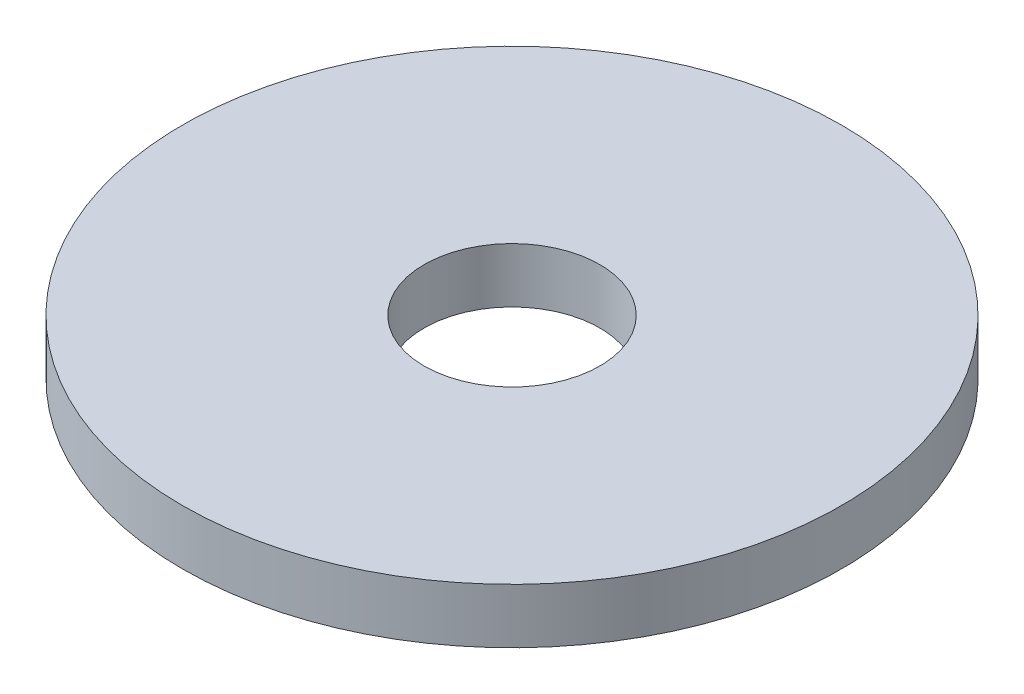
ISO-10303-21;
HEADER;
FILE_DESCRIPTION(('STEP AP214'),'2;1');
FILE_NAME('part.step','',(''),(''),'','','');
FILE_SCHEMA(('AUTOMOTIVE_DESIGN { 1 0 10303 214 1 1 1 1 }'));
ENDSEC;
DATA;
#1=APPLICATION_CONTEXT('core data for automotive mechanical design processes');
#2=APPLICATION_PROTOCOL_DEFINITION('international standard','automotive_design',2000,#1);
#3=PRODUCT_CONTEXT('',#1,'mechanical');
#4=PRODUCT('Part','Part','',(#3));
#5=PRODUCT_RELATED_PRODUCT_CATEGORY('part','',(#4));
#6=PRODUCT_DEFINITION_FORMATION('','',#4);
#7=PRODUCT_DEFINITION_CONTEXT('part definition',#1,'design');
#8=PRODUCT_DEFINITION('design','',#6,#7);
#9=PRODUCT_DEFINITION_SHAPE('','',#8);
#10=(LENGTH_UNIT() NAMED_UNIT(*) SI_UNIT(.MILLI.,.METRE.));
#11=(NAMED_UNIT(*) PLANE_ANGLE_UNIT() SI_UNIT($,.RADIAN.));
#12=(NAMED_UNIT(*) SI_UNIT($,.STERADIAN.) SOLID_ANGLE_UNIT());
#13=UNCERTAINTY_MEASURE_WITH_UNIT(LENGTH_MEASURE(1.E-05),#10,'distance_accuracy_value','');
#14=(GEOMETRIC_REPRESENTATION_CONTEXT(3) GLOBAL_UNCERTAINTY_ASSIGNED_CONTEXT((#13)) GLOBAL_UNIT_ASSIGNED_CONTEXT((#10,
#11,#12)) REPRESENTATION_CONTEXT('',''));
#15=CARTESIAN_POINT('',(0.,0.,0.));
#16=DIRECTION('',(0.,0.,1.));
#17=DIRECTION('',(1.,0.,0.));
#18=AXIS2_PLACEMENT_3D('',#15,#16,#17);
#19=CARTESIAN_POINT('',(0.,1.,0.));
#20=DIRECTION('',(0.,1.,0.));
#21=DIRECTION('',(0.,0.,1.));
#22=AXIS2_PLACEMENT_3D('',#19,#20,#21);
#23=PLANE('',#22);
#24=CARTESIAN_POINT('',(0.,1.,0.));
#25=DIRECTION('',(0.,1.,0.));
#26=DIRECTION('',(0.,0.,1.));
#27=AXIS2_PLACEMENT_3D('',#24,#25,#26);
#28=CIRCLE('',#27,6.);
#29=CARTESIAN_POINT('',(0.,1.,6.));
#30=VERTEX_POINT('',#29);
#31=EDGE_CURVE('E10',#30,#30,#28,.T.);
#32=ORIENTED_EDGE('',*,*,#31,.T.);
#33=EDGE_LOOP('',(#32));
#34=FACE_BOUND('',#33,.T.);
#35=CARTESIAN_POINT('',(0.,1.,0.));
#36=DIRECTION('',(0.,1.,0.));
#37=DIRECTION('',(0.,0.,1.));
#38=AXIS2_PLACEMENT_3D('',#35,#36,#37);
#39=CIRCLE('',#38,1.6);
#40=CARTESIAN_POINT('',(0.,1.,1.6));
#41=VERTEX_POINT('',#40);
#42=EDGE_CURVE('E44',#41,#41,#39,.T.);
#43=ORIENTED_EDGE('',*,*,#42,.F.);
#44=EDGE_LOOP('',(#43));
#45=FACE_BOUND('',#44,.T.);
#46=ADVANCED_FACE('F33',(#34,#45),#23,.T.);
#47=CARTESIAN_POINT('',(0.,0.,0.));
#48=DIRECTION('',(0.,1.,0.));
#49=DIRECTION('',(0.,0.,1.));
#50=AXIS2_PLACEMENT_3D('',#47,#48,#49);
#51=PLANE('',#50);
#52=CARTESIAN_POINT('',(0.,0.,0.));
#53=DIRECTION('',(0.,1.,0.));
#54=DIRECTION('',(0.,0.,1.));
#55=AXIS2_PLACEMENT_3D('',#52,#53,#54);
#56=CIRCLE('',#55,6.);
#57=CARTESIAN_POINT('',(0.,0.,6.));
#58=VERTEX_POINT('',#57);
#59=EDGE_CURVE('E37',#58,#58,#56,.T.);
#60=ORIENTED_EDGE('',*,*,#59,.F.);
#61=EDGE_LOOP('',(#60));
#62=FACE_BOUND('',#61,.T.);
#63=CARTESIAN_POINT('',(0.,0.,0.));
#64=DIRECTION('',(0.,1.,0.));
#65=DIRECTION('',(0.,0.,1.));
#66=AXIS2_PLACEMENT_3D('',#63,#64,#65);
#67=CIRCLE('',#66,1.6);
#68=CARTESIAN_POINT('',(0.,0.,1.6));
#69=VERTEX_POINT('',#68);
#70=EDGE_CURVE('E46',#69,#69,#67,.T.);
#71=ORIENTED_EDGE('',*,*,#70,.T.);
#72=EDGE_LOOP('',(#71));
#73=FACE_BOUND('',#72,.T.);
#74=ADVANCED_FACE('F56',(#62,#73),#51,.F.);
#75=CARTESIAN_POINT('',(0.,1.,0.));
#76=DIRECTION('',(0.,-1.,0.));
#77=DIRECTION('',(0.,0.,-1.));
#78=AXIS2_PLACEMENT_3D('',#75,#76,#77);
#79=CYLINDRICAL_SURFACE('',#78,6.);
#80=ORIENTED_EDGE('',*,*,#31,.F.);
#81=EDGE_LOOP('',(#80));
#82=FACE_BOUND('',#81,.T.);
#83=ORIENTED_EDGE('',*,*,#59,.T.);
#84=EDGE_LOOP('',(#83));
#85=FACE_BOUND('',#84,.T.);
#86=ADVANCED_FACE('F35',(#82,#85),#79,.T.);
#87=CARTESIAN_POINT('',(0.,1.,0.));
#88=DIRECTION('',(0.,-1.,0.));
#89=DIRECTION('',(0.,0.,-1.));
#90=AXIS2_PLACEMENT_3D('',#87,#88,#89);
#91=CYLINDRICAL_SURFACE('',#90,1.6);
#92=ORIENTED_EDGE('',*,*,#42,.T.);
#93=EDGE_LOOP('',(#92));
#94=FACE_BOUND('',#93,.T.);
#95=ORIENTED_EDGE('',*,*,#70,.F.);
#96=EDGE_LOOP('',(#95));
#97=FACE_BOUND('',#96,.T.);
#98=ADVANCED_FACE('F52',(#94,#97),#91,.F.);
#99=CLOSED_SHELL('',(#46,#74,#86,#98));
#100=MANIFOLD_SOLID_BREP('B2',#99);
#101=ADVANCED_BREP_SHAPE_REPRESENTATION('',(#18,#100),#14);
#102=SHAPE_DEFINITION_REPRESENTATION(#9,#101);
ENDSEC;
END-ISO-10303-21;
